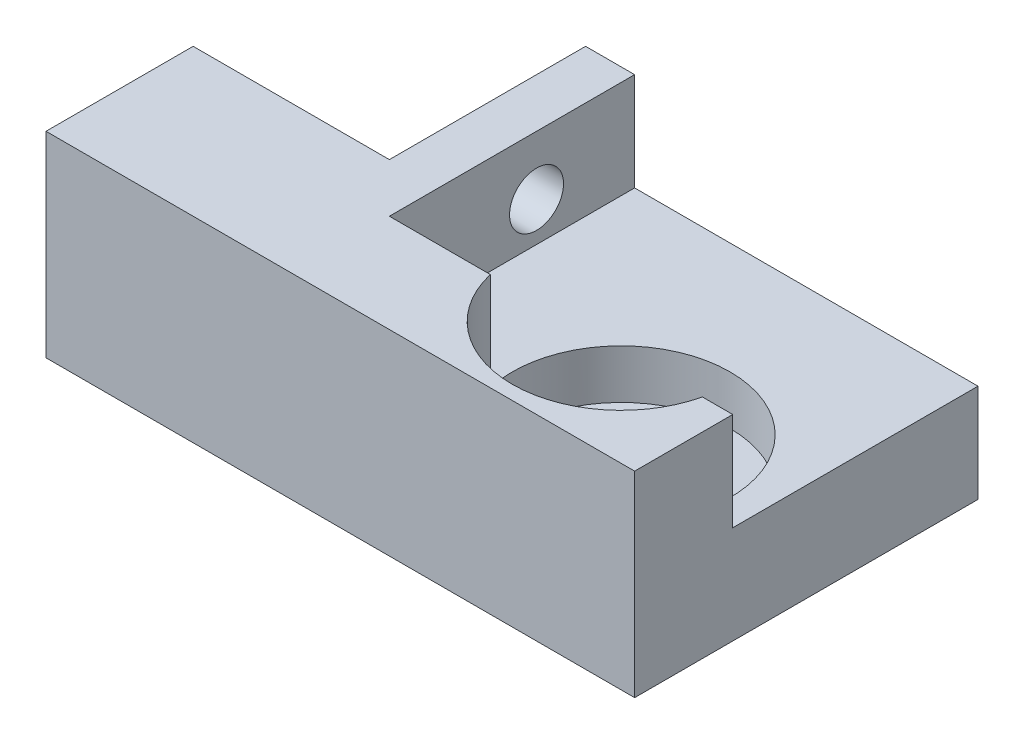
ISO-10303-21;
HEADER;
FILE_DESCRIPTION(('STEP AP214'),'2;1');
FILE_NAME('part.step','',(''),(''),'','','');
FILE_SCHEMA(('AUTOMOTIVE_DESIGN { 1 0 10303 214 1 1 1 1 }'));
ENDSEC;
DATA;
#1=APPLICATION_CONTEXT('core data for automotive mechanical design processes');
#2=APPLICATION_PROTOCOL_DEFINITION('international standard','automotive_design',2000,#1);
#3=PRODUCT_CONTEXT('',#1,'mechanical');
#4=PRODUCT('Part','Part','',(#3));
#5=PRODUCT_RELATED_PRODUCT_CATEGORY('part','',(#4));
#6=PRODUCT_DEFINITION_FORMATION('','',#4);
#7=PRODUCT_DEFINITION_CONTEXT('part definition',#1,'design');
#8=PRODUCT_DEFINITION('design','',#6,#7);
#9=PRODUCT_DEFINITION_SHAPE('','',#8);
#10=(LENGTH_UNIT() NAMED_UNIT(*) SI_UNIT(.MILLI.,.METRE.));
#11=(NAMED_UNIT(*) PLANE_ANGLE_UNIT() SI_UNIT($,.RADIAN.));
#12=(NAMED_UNIT(*) SI_UNIT($,.STERADIAN.) SOLID_ANGLE_UNIT());
#13=UNCERTAINTY_MEASURE_WITH_UNIT(LENGTH_MEASURE(1.E-05),#10,'distance_accuracy_value','');
#14=(GEOMETRIC_REPRESENTATION_CONTEXT(3) GLOBAL_UNCERTAINTY_ASSIGNED_CONTEXT((#13)) GLOBAL_UNIT_ASSIGNED_CONTEXT((#10,
#11,#12)) REPRESENTATION_CONTEXT('',''));
#15=CARTESIAN_POINT('',(0.,0.,0.));
#16=DIRECTION('',(0.,0.,1.));
#17=DIRECTION('',(1.,0.,0.));
#18=AXIS2_PLACEMENT_3D('',#15,#16,#17);
#19=CARTESIAN_POINT('',(60.,10.,-10.));
#20=DIRECTION('',(0.,0.,1.));
#21=DIRECTION('',(1.,0.,0.));
#22=AXIS2_PLACEMENT_3D('',#19,#20,#21);
#23=PLANE('',#22);
#24=DIRECTION('',(1.,0.,0.));
#25=VECTOR('',#24,1.);
#26=CARTESIAN_POINT('',(60.,10.,-10.));
#27=LINE('',#26,#25);
#28=CARTESIAN_POINT('',(56.9088169486613,10.,-10.));
#29=VERTEX_POINT('',#28);
#30=CARTESIAN_POINT('',(60.,10.,-10.));
#31=VERTEX_POINT('',#30);
#32=EDGE_CURVE('E133',#29,#31,#27,.T.);
#33=ORIENTED_EDGE('',*,*,#32,.F.);
#34=DIRECTION('',(0.,1.,0.));
#35=VECTOR('',#34,1.);
#36=CARTESIAN_POINT('',(56.9088169486613,5.,-10.));
#37=LINE('',#36,#35);
#38=CARTESIAN_POINT('',(56.9088169486613,20.,-10.));
#39=VERTEX_POINT('',#38);
#40=EDGE_CURVE('E48',#29,#39,#37,.T.);
#41=ORIENTED_EDGE('',*,*,#40,.T.);
#42=DIRECTION('',(1.,0.,0.));
#43=VECTOR('',#42,1.);
#44=CARTESIAN_POINT('',(60.,20.,-10.));
#45=LINE('',#44,#43);
#46=CARTESIAN_POINT('',(60.,20.,-10.));
#47=VERTEX_POINT('',#46);
#48=EDGE_CURVE('E142',#39,#47,#45,.T.);
#49=ORIENTED_EDGE('',*,*,#48,.T.);
#50=DIRECTION('',(0.,1.,0.));
#51=VECTOR('',#50,1.);
#52=CARTESIAN_POINT('',(60.,10.,-10.));
#53=LINE('',#52,#51);
#54=EDGE_CURVE('E146',#31,#47,#53,.T.);
#55=ORIENTED_EDGE('',*,*,#54,.F.);
#56=EDGE_LOOP('',(#33,#41,#49,#55));
#57=FACE_BOUND('',#56,.T.);
#58=ADVANCED_FACE('F33',(#57),#23,.F.);
#59=CARTESIAN_POINT('',(0.,20.,0.));
#60=DIRECTION('',(1.,0.,0.));
#61=DIRECTION('',(0.,0.,-1.));
#62=AXIS2_PLACEMENT_3D('',#59,#60,#61);
#63=PLANE('',#62);
#64=DIRECTION('',(0.,0.,1.));
#65=VECTOR('',#64,1.);
#66=CARTESIAN_POINT('',(0.,0.,0.));
#67=LINE('',#66,#65);
#68=CARTESIAN_POINT('',(0.,0.,-15.));
#69=VERTEX_POINT('',#68);
#70=CARTESIAN_POINT('',(0.,0.,0.));
#71=VERTEX_POINT('',#70);
#72=EDGE_CURVE('E149',#69,#71,#67,.T.);
#73=ORIENTED_EDGE('',*,*,#72,.T.);
#74=DIRECTION('',(0.,-1.,0.));
#75=VECTOR('',#74,1.);
#76=CARTESIAN_POINT('',(0.,20.,0.));
#77=LINE('',#76,#75);
#78=CARTESIAN_POINT('',(0.,20.,0.));
#79=VERTEX_POINT('',#78);
#80=EDGE_CURVE('E41',#79,#71,#77,.T.);
#81=ORIENTED_EDGE('',*,*,#80,.F.);
#82=DIRECTION('',(0.,0.,1.));
#83=VECTOR('',#82,1.);
#84=CARTESIAN_POINT('',(0.,20.,0.));
#85=LINE('',#84,#83);
#86=CARTESIAN_POINT('',(0.,20.,-15.));
#87=VERTEX_POINT('',#86);
#88=EDGE_CURVE('E151',#87,#79,#85,.T.);
#89=ORIENTED_EDGE('',*,*,#88,.F.);
#90=DIRECTION('',(0.,-1.,0.));
#91=VECTOR('',#90,1.);
#92=CARTESIAN_POINT('',(0.,20.,-15.));
#93=LINE('',#92,#91);
#94=EDGE_CURVE('E166',#87,#69,#93,.T.);
#95=ORIENTED_EDGE('',*,*,#94,.T.);
#96=EDGE_LOOP('',(#73,#81,#89,#95));
#97=FACE_BOUND('',#96,.T.);
#98=ADVANCED_FACE('F35',(#97),#63,.F.);
#99=CARTESIAN_POINT('',(0.,20.,0.));
#100=DIRECTION('',(0.,0.,-1.));
#101=DIRECTION('',(-1.,0.,0.));
#102=AXIS2_PLACEMENT_3D('',#99,#100,#101);
#103=PLANE('',#102);
#104=DIRECTION('',(1.,0.,0.));
#105=VECTOR('',#104,1.);
#106=CARTESIAN_POINT('',(0.,0.,0.));
#107=LINE('',#106,#105);
#108=CARTESIAN_POINT('',(60.,0.,0.));
#109=VERTEX_POINT('',#108);
#110=EDGE_CURVE('E169',#71,#109,#107,.T.);
#111=ORIENTED_EDGE('',*,*,#110,.T.);
#112=DIRECTION('',(0.,-1.,0.));
#113=VECTOR('',#112,1.);
#114=CARTESIAN_POINT('',(60.,20.,0.));
#115=LINE('',#114,#113);
#116=CARTESIAN_POINT('',(60.,20.,0.));
#117=VERTEX_POINT('',#116);
#118=EDGE_CURVE('E189',#117,#109,#115,.T.);
#119=ORIENTED_EDGE('',*,*,#118,.F.);
#120=DIRECTION('',(1.,0.,0.));
#121=VECTOR('',#120,1.);
#122=CARTESIAN_POINT('',(0.,20.,0.));
#123=LINE('',#122,#121);
#124=EDGE_CURVE('E154',#79,#117,#123,.T.);
#125=ORIENTED_EDGE('',*,*,#124,.F.);
#126=ORIENTED_EDGE('',*,*,#80,.T.);
#127=EDGE_LOOP('',(#111,#119,#125,#126));
#128=FACE_BOUND('',#127,.T.);
#129=ADVANCED_FACE('F194',(#128),#103,.F.);
#130=CARTESIAN_POINT('',(60.,20.,0.));
#131=DIRECTION('',(-1.,0.,0.));
#132=DIRECTION('',(0.,0.,1.));
#133=AXIS2_PLACEMENT_3D('',#130,#131,#132);
#134=PLANE('',#133);
#135=DIRECTION('',(0.,0.,-1.));
#136=VECTOR('',#135,1.);
#137=CARTESIAN_POINT('',(60.,10.,-35.));
#138=LINE('',#137,#136);
#139=CARTESIAN_POINT('',(60.,10.,-35.));
#140=VERTEX_POINT('',#139);
#141=EDGE_CURVE('E145',#31,#140,#138,.T.);
#142=ORIENTED_EDGE('',*,*,#141,.F.);
#143=ORIENTED_EDGE('',*,*,#54,.T.);
#144=DIRECTION('',(0.,0.,-1.));
#145=VECTOR('',#144,1.);
#146=CARTESIAN_POINT('',(60.,20.,0.));
#147=LINE('',#146,#145);
#148=EDGE_CURVE('E157',#117,#47,#147,.T.);
#149=ORIENTED_EDGE('',*,*,#148,.F.);
#150=ORIENTED_EDGE('',*,*,#118,.T.);
#151=DIRECTION('',(0.,0.,-1.));
#152=VECTOR('',#151,1.);
#153=CARTESIAN_POINT('',(60.,0.,0.));
#154=LINE('',#153,#152);
#155=CARTESIAN_POINT('',(60.,0.,-35.));
#156=VERTEX_POINT('',#155);
#157=EDGE_CURVE('E171',#109,#156,#154,.T.);
#158=ORIENTED_EDGE('',*,*,#157,.T.);
#159=DIRECTION('',(0.,-1.,0.));
#160=VECTOR('',#159,1.);
#161=CARTESIAN_POINT('',(60.,20.,-35.));
#162=LINE('',#161,#160);
#163=EDGE_CURVE('E187',#140,#156,#162,.T.);
#164=ORIENTED_EDGE('',*,*,#163,.F.);
#165=EDGE_LOOP('',(#142,#143,#149,#150,#158,#164));
#166=FACE_BOUND('',#165,.T.);
#167=ADVANCED_FACE('F209',(#166),#134,.F.);
#168=CARTESIAN_POINT('',(20.,20.,-35.));
#169=DIRECTION('',(0.,0.,1.));
#170=DIRECTION('',(1.,0.,0.));
#171=AXIS2_PLACEMENT_3D('',#168,#169,#170);
#172=PLANE('',#171);
#173=DIRECTION('',(-1.,0.,0.));
#174=VECTOR('',#173,1.);
#175=CARTESIAN_POINT('',(20.,20.,-35.));
#176=LINE('',#175,#174);
#177=CARTESIAN_POINT('',(25.,20.,-35.));
#178=VERTEX_POINT('',#177);
#179=CARTESIAN_POINT('',(20.,20.,-35.));
#180=VERTEX_POINT('',#179);
#181=EDGE_CURVE('E160',#178,#180,#176,.T.);
#182=ORIENTED_EDGE('',*,*,#181,.F.);
#183=DIRECTION('',(0.,1.,0.));
#184=VECTOR('',#183,1.);
#185=CARTESIAN_POINT('',(25.,10.,-35.));
#186=LINE('',#185,#184);
#187=CARTESIAN_POINT('',(25.,10.,-35.));
#188=VERTEX_POINT('',#187);
#189=EDGE_CURVE('E55',#188,#178,#186,.T.);
#190=ORIENTED_EDGE('',*,*,#189,.F.);
#191=DIRECTION('',(-1.,0.,0.));
#192=VECTOR('',#191,1.);
#193=CARTESIAN_POINT('',(60.,10.,-35.));
#194=LINE('',#193,#192);
#195=EDGE_CURVE('E227',#140,#188,#194,.T.);
#196=ORIENTED_EDGE('',*,*,#195,.F.);
#197=ORIENTED_EDGE('',*,*,#163,.T.);
#198=DIRECTION('',(-1.,0.,0.));
#199=VECTOR('',#198,1.);
#200=CARTESIAN_POINT('',(20.,0.,-35.));
#201=LINE('',#200,#199);
#202=CARTESIAN_POINT('',(20.,0.,-35.));
#203=VERTEX_POINT('',#202);
#204=EDGE_CURVE('E174',#156,#203,#201,.T.);
#205=ORIENTED_EDGE('',*,*,#204,.T.);
#206=DIRECTION('',(0.,-1.,0.));
#207=VECTOR('',#206,1.);
#208=CARTESIAN_POINT('',(20.,20.,-35.));
#209=LINE('',#208,#207);
#210=EDGE_CURVE('E184',#180,#203,#209,.T.);
#211=ORIENTED_EDGE('',*,*,#210,.F.);
#212=EDGE_LOOP('',(#182,#190,#196,#197,#205,#211));
#213=FACE_BOUND('',#212,.T.);
#214=ADVANCED_FACE('F225',(#213),#172,.F.);
#215=CARTESIAN_POINT('',(20.,20.,-35.));
#216=DIRECTION('',(1.,0.,0.));
#217=DIRECTION('',(0.,0.,-1.));
#218=AXIS2_PLACEMENT_3D('',#215,#216,#217);
#219=PLANE('',#218);
#220=CARTESIAN_POINT('',(20.,14.,-25.));
#221=DIRECTION('',(1.,0.,0.));
#222=DIRECTION('',(0.,0.,-1.));
#223=AXIS2_PLACEMENT_3D('',#220,#221,#222);
#224=CIRCLE('',#223,2.75);
#225=CARTESIAN_POINT('',(20.,14.,-27.75));
#226=VERTEX_POINT('',#225);
#227=EDGE_CURVE('E238',#226,#226,#224,.T.);
#228=ORIENTED_EDGE('',*,*,#227,.T.);
#229=EDGE_LOOP('',(#228));
#230=FACE_BOUND('',#229,.T.);
#231=DIRECTION('',(0.,0.,1.));
#232=VECTOR('',#231,1.);
#233=CARTESIAN_POINT('',(20.,0.,-35.));
#234=LINE('',#233,#232);
#235=CARTESIAN_POINT('',(20.,0.,-15.));
#236=VERTEX_POINT('',#235);
#237=EDGE_CURVE('E176',#203,#236,#234,.T.);
#238=ORIENTED_EDGE('',*,*,#237,.T.);
#239=DIRECTION('',(0.,-1.,0.));
#240=VECTOR('',#239,1.);
#241=CARTESIAN_POINT('',(20.,20.,-15.));
#242=LINE('',#241,#240);
#243=CARTESIAN_POINT('',(20.,20.,-15.));
#244=VERTEX_POINT('',#243);
#245=EDGE_CURVE('E181',#244,#236,#242,.T.);
#246=ORIENTED_EDGE('',*,*,#245,.F.);
#247=DIRECTION('',(0.,0.,1.));
#248=VECTOR('',#247,1.);
#249=CARTESIAN_POINT('',(20.,20.,-35.));
#250=LINE('',#249,#248);
#251=EDGE_CURVE('E162',#180,#244,#250,.T.);
#252=ORIENTED_EDGE('',*,*,#251,.F.);
#253=ORIENTED_EDGE('',*,*,#210,.T.);
#254=EDGE_LOOP('',(#238,#246,#252,#253));
#255=FACE_BOUND('',#254,.T.);
#256=ADVANCED_FACE('F221',(#230,#255),#219,.F.);
#257=CARTESIAN_POINT('',(0.,20.,-15.));
#258=DIRECTION('',(0.,0.,1.));
#259=DIRECTION('',(1.,0.,0.));
#260=AXIS2_PLACEMENT_3D('',#257,#258,#259);
#261=PLANE('',#260);
#262=DIRECTION('',(-1.,0.,0.));
#263=VECTOR('',#262,1.);
#264=CARTESIAN_POINT('',(0.,0.,-15.));
#265=LINE('',#264,#263);
#266=EDGE_CURVE('E155',#236,#69,#265,.T.);
#267=ORIENTED_EDGE('',*,*,#266,.T.);
#268=ORIENTED_EDGE('',*,*,#94,.F.);
#269=DIRECTION('',(-1.,0.,0.));
#270=VECTOR('',#269,1.);
#271=CARTESIAN_POINT('',(0.,20.,-15.));
#272=LINE('',#271,#270);
#273=EDGE_CURVE('E164',#244,#87,#272,.T.);
#274=ORIENTED_EDGE('',*,*,#273,.F.);
#275=ORIENTED_EDGE('',*,*,#245,.T.);
#276=EDGE_LOOP('',(#267,#268,#274,#275));
#277=FACE_BOUND('',#276,.T.);
#278=ADVANCED_FACE('F219',(#277),#261,.F.);
#279=CARTESIAN_POINT('',(0.,20.,0.));
#280=DIRECTION('',(0.,-1.,0.));
#281=DIRECTION('',(0.,0.,-1.));
#282=AXIS2_PLACEMENT_3D('',#279,#280,#281);
#283=PLANE('',#282);
#284=ORIENTED_EDGE('',*,*,#48,.F.);
#285=CARTESIAN_POINT('',(46.1,20.,-12.5257624928588));
#286=DIRECTION('',(0.,-1.,0.));
#287=DIRECTION('',(0.,0.,-1.));
#288=AXIS2_PLACEMENT_3D('',#285,#286,#287);
#289=CIRCLE('',#288,11.1);
#290=CARTESIAN_POINT('',(35.2911830513387,20.,-10.));
#291=VERTEX_POINT('',#290);
#292=EDGE_CURVE('E143',#39,#291,#289,.T.);
#293=ORIENTED_EDGE('',*,*,#292,.T.);
#294=CARTESIAN_POINT('',(25.,20.,-10.));
#295=VERTEX_POINT('',#294);
#296=EDGE_CURVE('E126',#295,#291,#45,.T.);
#297=ORIENTED_EDGE('',*,*,#296,.F.);
#298=DIRECTION('',(0.,0.,1.));
#299=VECTOR('',#298,1.);
#300=CARTESIAN_POINT('',(25.,20.,-35.));
#301=LINE('',#300,#299);
#302=EDGE_CURVE('E140',#178,#295,#301,.T.);
#303=ORIENTED_EDGE('',*,*,#302,.F.);
#304=ORIENTED_EDGE('',*,*,#181,.T.);
#305=ORIENTED_EDGE('',*,*,#251,.T.);
#306=ORIENTED_EDGE('',*,*,#273,.T.);
#307=ORIENTED_EDGE('',*,*,#88,.T.);
#308=ORIENTED_EDGE('',*,*,#124,.T.);
#309=ORIENTED_EDGE('',*,*,#148,.T.);
#310=EDGE_LOOP('',(#284,#293,#297,#303,#304,#305,#306,#307,#308,#309));
#311=FACE_BOUND('',#310,.T.);
#312=ADVANCED_FACE('F214',(#311),#283,.F.);
#313=CARTESIAN_POINT('',(0.,0.,0.));
#314=DIRECTION('',(0.,-1.,0.));
#315=DIRECTION('',(0.,0.,-1.));
#316=AXIS2_PLACEMENT_3D('',#313,#314,#315);
#317=PLANE('',#316);
#318=CARTESIAN_POINT('',(46.1,0.,-12.5257624928588));
#319=DIRECTION('',(0.,1.,0.));
#320=DIRECTION('',(0.,0.,1.));
#321=AXIS2_PLACEMENT_3D('',#318,#319,#320);
#322=CIRCLE('',#321,5.);
#323=CARTESIAN_POINT('',(46.1,0.,-7.52576249285878));
#324=VERTEX_POINT('',#323);
#325=EDGE_CURVE('E234',#324,#324,#322,.T.);
#326=ORIENTED_EDGE('',*,*,#325,.T.);
#327=EDGE_LOOP('',(#326));
#328=FACE_BOUND('',#327,.T.);
#329=ORIENTED_EDGE('',*,*,#72,.F.);
#330=ORIENTED_EDGE('',*,*,#266,.F.);
#331=ORIENTED_EDGE('',*,*,#237,.F.);
#332=ORIENTED_EDGE('',*,*,#204,.F.);
#333=ORIENTED_EDGE('',*,*,#157,.F.);
#334=ORIENTED_EDGE('',*,*,#110,.F.);
#335=EDGE_LOOP('',(#329,#330,#331,#332,#333,#334));
#336=FACE_BOUND('',#335,.T.);
#337=ADVANCED_FACE('F202',(#328,#336),#317,.T.);
#338=ORIENTED_EDGE('',*,*,#296,.T.);
#339=DIRECTION('',(0.,1.,0.));
#340=VECTOR('',#339,1.);
#341=CARTESIAN_POINT('',(35.2911830513387,5.,-10.));
#342=LINE('',#341,#340);
#343=CARTESIAN_POINT('',(35.2911830513387,10.,-10.));
#344=VERTEX_POINT('',#343);
#345=EDGE_CURVE('E115',#291,#344,#342,.F.);
#346=ORIENTED_EDGE('',*,*,#345,.T.);
#347=CARTESIAN_POINT('',(25.,10.,-10.));
#348=VERTEX_POINT('',#347);
#349=EDGE_CURVE('E124',#348,#344,#27,.T.);
#350=ORIENTED_EDGE('',*,*,#349,.F.);
#351=DIRECTION('',(0.,1.,0.));
#352=VECTOR('',#351,1.);
#353=CARTESIAN_POINT('',(25.,10.,-10.));
#354=LINE('',#353,#352);
#355=EDGE_CURVE('E135',#348,#295,#354,.T.);
#356=ORIENTED_EDGE('',*,*,#355,.T.);
#357=EDGE_LOOP('',(#338,#346,#350,#356));
#358=FACE_BOUND('',#357,.T.);
#359=ADVANCED_FACE('F123',(#358),#23,.F.);
#360=CARTESIAN_POINT('',(25.,10.,-35.));
#361=DIRECTION('',(-1.,0.,0.));
#362=DIRECTION('',(0.,0.,1.));
#363=AXIS2_PLACEMENT_3D('',#360,#361,#362);
#364=PLANE('',#363);
#365=CARTESIAN_POINT('',(25.,14.,-25.));
#366=DIRECTION('',(1.,0.,0.));
#367=DIRECTION('',(0.,0.,-1.));
#368=AXIS2_PLACEMENT_3D('',#365,#366,#367);
#369=CIRCLE('',#368,2.75);
#370=CARTESIAN_POINT('',(25.,14.,-27.75));
#371=VERTEX_POINT('',#370);
#372=EDGE_CURVE('E243',#371,#371,#369,.T.);
#373=ORIENTED_EDGE('',*,*,#372,.F.);
#374=EDGE_LOOP('',(#373));
#375=FACE_BOUND('',#374,.T.);
#376=ORIENTED_EDGE('',*,*,#302,.T.);
#377=ORIENTED_EDGE('',*,*,#355,.F.);
#378=DIRECTION('',(0.,0.,1.));
#379=VECTOR('',#378,1.);
#380=CARTESIAN_POINT('',(25.,10.,-35.));
#381=LINE('',#380,#379);
#382=EDGE_CURVE('E132',#188,#348,#381,.T.);
#383=ORIENTED_EDGE('',*,*,#382,.F.);
#384=ORIENTED_EDGE('',*,*,#189,.T.);
#385=EDGE_LOOP('',(#376,#377,#383,#384));
#386=FACE_BOUND('',#385,.T.);
#387=ADVANCED_FACE('F250',(#375,#386),#364,.F.);
#388=CARTESIAN_POINT('',(0.,10.,0.));
#389=DIRECTION('',(0.,-1.,0.));
#390=DIRECTION('',(0.,0.,-1.));
#391=AXIS2_PLACEMENT_3D('',#388,#389,#390);
#392=PLANE('',#391);
#393=ORIENTED_EDGE('',*,*,#349,.T.);
#394=CARTESIAN_POINT('',(46.1,10.,-12.5257624928588));
#395=DIRECTION('',(0.,-1.,0.));
#396=DIRECTION('',(0.,0.,-1.));
#397=AXIS2_PLACEMENT_3D('',#394,#395,#396);
#398=CIRCLE('',#397,11.1);
#399=EDGE_CURVE('E11',#344,#29,#398,.T.);
#400=ORIENTED_EDGE('',*,*,#399,.T.);
#401=ORIENTED_EDGE('',*,*,#32,.T.);
#402=ORIENTED_EDGE('',*,*,#141,.T.);
#403=ORIENTED_EDGE('',*,*,#195,.T.);
#404=ORIENTED_EDGE('',*,*,#382,.T.);
#405=EDGE_LOOP('',(#393,#400,#401,#402,#403,#404));
#406=FACE_BOUND('',#405,.T.);
#407=ADVANCED_FACE('F130',(#406),#392,.F.);
#408=CARTESIAN_POINT('',(46.1,5.,-12.5257624928588));
#409=DIRECTION('',(0.,1.,0.));
#410=DIRECTION('',(0.,0.,1.));
#411=AXIS2_PLACEMENT_3D('',#408,#409,#410);
#412=CYLINDRICAL_SURFACE('',#411,11.1);
#413=CARTESIAN_POINT('',(46.1,5.,-12.5257624928588));
#414=DIRECTION('',(0.,1.,0.));
#415=DIRECTION('',(0.,0.,1.));
#416=AXIS2_PLACEMENT_3D('',#413,#414,#415);
#417=CIRCLE('',#416,11.1);
#418=CARTESIAN_POINT('',(46.1,5.,-1.42576249285878));
#419=VERTEX_POINT('',#418);
#420=EDGE_CURVE('E127',#419,#419,#417,.T.);
#421=ORIENTED_EDGE('',*,*,#420,.F.);
#422=EDGE_LOOP('',(#421));
#423=FACE_BOUND('',#422,.T.);
#424=ORIENTED_EDGE('',*,*,#40,.F.);
#425=ORIENTED_EDGE('',*,*,#399,.F.);
#426=ORIENTED_EDGE('',*,*,#345,.F.);
#427=ORIENTED_EDGE('',*,*,#292,.F.);
#428=EDGE_LOOP('',(#424,#425,#426,#427));
#429=FACE_BOUND('',#428,.T.);
#430=ADVANCED_FACE('F114',(#423,#429),#412,.F.);
#431=CARTESIAN_POINT('',(46.1,5.,-12.5257624928588));
#432=DIRECTION('',(0.,1.,0.));
#433=DIRECTION('',(0.,0.,1.));
#434=AXIS2_PLACEMENT_3D('',#431,#432,#433);
#435=PLANE('',#434);
#436=CARTESIAN_POINT('',(46.1,5.,-12.5257624928588));
#437=DIRECTION('',(0.,1.,0.));
#438=DIRECTION('',(0.,0.,1.));
#439=AXIS2_PLACEMENT_3D('',#436,#437,#438);
#440=CIRCLE('',#439,5.);
#441=CARTESIAN_POINT('',(46.1,5.,-7.52576249285878));
#442=VERTEX_POINT('',#441);
#443=EDGE_CURVE('E235',#442,#442,#440,.T.);
#444=ORIENTED_EDGE('',*,*,#443,.F.);
#445=EDGE_LOOP('',(#444));
#446=FACE_BOUND('',#445,.T.);
#447=ORIENTED_EDGE('',*,*,#420,.T.);
#448=EDGE_LOOP('',(#447));
#449=FACE_BOUND('',#448,.T.);
#450=ADVANCED_FACE('F329',(#446,#449),#435,.T.);
#451=CARTESIAN_POINT('',(46.1,0.,-12.5257624928588));
#452=DIRECTION('',(0.,1.,0.));
#453=DIRECTION('',(0.,0.,1.));
#454=AXIS2_PLACEMENT_3D('',#451,#452,#453);
#455=CYLINDRICAL_SURFACE('',#454,5.);
#456=ORIENTED_EDGE('',*,*,#325,.F.);
#457=EDGE_LOOP('',(#456));
#458=FACE_BOUND('',#457,.T.);
#459=ORIENTED_EDGE('',*,*,#443,.T.);
#460=EDGE_LOOP('',(#459));
#461=FACE_BOUND('',#460,.T.);
#462=ADVANCED_FACE('F342',(#458,#461),#455,.F.);
#463=CARTESIAN_POINT('',(0.,14.,-25.));
#464=DIRECTION('',(1.,0.,0.));
#465=DIRECTION('',(0.,0.,-1.));
#466=AXIS2_PLACEMENT_3D('',#463,#464,#465);
#467=CYLINDRICAL_SURFACE('',#466,2.75);
#468=ORIENTED_EDGE('',*,*,#372,.T.);
#469=EDGE_LOOP('',(#468));
#470=FACE_BOUND('',#469,.T.);
#471=ORIENTED_EDGE('',*,*,#227,.F.);
#472=EDGE_LOOP('',(#471));
#473=FACE_BOUND('',#472,.T.);
#474=ADVANCED_FACE('F247',(#470,#473),#467,.F.);
#475=CLOSED_SHELL('',(#58,#98,#129,#167,#214,#256,#278,#312,#337,#359,#387,#407,#430,#450,#462,#474));
#476=MANIFOLD_SOLID_BREP('B2',#475);
#477=ADVANCED_BREP_SHAPE_REPRESENTATION('',(#18,#476),#14);
#478=SHAPE_DEFINITION_REPRESENTATION(#9,#477);
ENDSEC;
END-ISO-10303-21;
